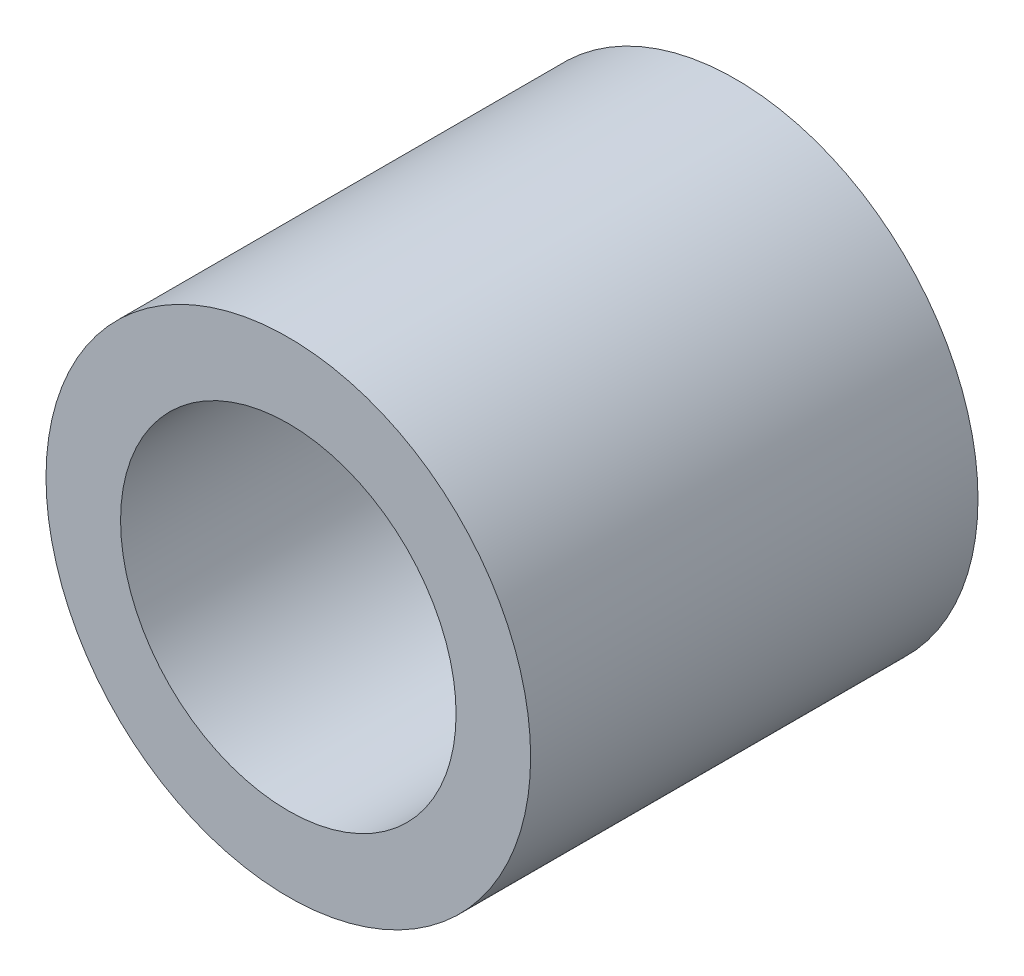
ISO-10303-21;
HEADER;
FILE_DESCRIPTION(('STEP AP214'),'2;1');
FILE_NAME('part.step','',(''),(''),'','','');
FILE_SCHEMA(('AUTOMOTIVE_DESIGN { 1 0 10303 214 1 1 1 1 }'));
ENDSEC;
DATA;
#1=APPLICATION_CONTEXT('core data for automotive mechanical design processes');
#2=APPLICATION_PROTOCOL_DEFINITION('international standard','automotive_design',2000,#1);
#3=PRODUCT_CONTEXT('',#1,'mechanical');
#4=PRODUCT('Part','Part','',(#3));
#5=PRODUCT_RELATED_PRODUCT_CATEGORY('part','',(#4));
#6=PRODUCT_DEFINITION_FORMATION('','',#4);
#7=PRODUCT_DEFINITION_CONTEXT('part definition',#1,'design');
#8=PRODUCT_DEFINITION('design','',#6,#7);
#9=PRODUCT_DEFINITION_SHAPE('','',#8);
#10=(LENGTH_UNIT() NAMED_UNIT(*) SI_UNIT(.MILLI.,.METRE.));
#11=(NAMED_UNIT(*) PLANE_ANGLE_UNIT() SI_UNIT($,.RADIAN.));
#12=(NAMED_UNIT(*) SI_UNIT($,.STERADIAN.) SOLID_ANGLE_UNIT());
#13=UNCERTAINTY_MEASURE_WITH_UNIT(LENGTH_MEASURE(1.E-05),#10,'distance_accuracy_value','');
#14=(GEOMETRIC_REPRESENTATION_CONTEXT(3) GLOBAL_UNCERTAINTY_ASSIGNED_CONTEXT((#13)) GLOBAL_UNIT_ASSIGNED_CONTEXT((#10,
#11,#12)) REPRESENTATION_CONTEXT('',''));
#15=CARTESIAN_POINT('',(0.,0.,0.));
#16=DIRECTION('',(0.,0.,1.));
#17=DIRECTION('',(1.,0.,0.));
#18=AXIS2_PLACEMENT_3D('',#15,#16,#17);
#19=CARTESIAN_POINT('',(0.,0.,6.));
#20=DIRECTION('',(0.,0.,1.));
#21=DIRECTION('',(1.,0.,0.));
#22=AXIS2_PLACEMENT_3D('',#19,#20,#21);
#23=PLANE('',#22);
#24=CARTESIAN_POINT('',(0.,0.,6.));
#25=DIRECTION('',(0.,0.,1.));
#26=DIRECTION('',(1.,0.,0.));
#27=AXIS2_PLACEMENT_3D('',#24,#25,#26);
#28=CIRCLE('',#27,3.25);
#29=CARTESIAN_POINT('',(3.25,0.,6.));
#30=VERTEX_POINT('',#29);
#31=EDGE_CURVE('E10',#30,#30,#28,.T.);
#32=ORIENTED_EDGE('',*,*,#31,.T.);
#33=EDGE_LOOP('',(#32));
#34=FACE_BOUND('',#33,.T.);
#35=CARTESIAN_POINT('',(0.,0.,6.));
#36=DIRECTION('',(0.,0.,1.));
#37=DIRECTION('',(1.,0.,0.));
#38=AXIS2_PLACEMENT_3D('',#35,#36,#37);
#39=CIRCLE('',#38,2.25);
#40=CARTESIAN_POINT('',(2.25,0.,6.));
#41=VERTEX_POINT('',#40);
#42=EDGE_CURVE('E41',#41,#41,#39,.T.);
#43=ORIENTED_EDGE('',*,*,#42,.F.);
#44=EDGE_LOOP('',(#43));
#45=FACE_BOUND('',#44,.T.);
#46=ADVANCED_FACE('F30',(#34,#45),#23,.T.);
#47=CARTESIAN_POINT('',(0.,0.,0.));
#48=DIRECTION('',(0.,0.,1.));
#49=DIRECTION('',(1.,0.,0.));
#50=AXIS2_PLACEMENT_3D('',#47,#48,#49);
#51=PLANE('',#50);
#52=CARTESIAN_POINT('',(0.,0.,0.));
#53=DIRECTION('',(0.,0.,1.));
#54=DIRECTION('',(1.,0.,0.));
#55=AXIS2_PLACEMENT_3D('',#52,#53,#54);
#56=CIRCLE('',#55,3.25);
#57=CARTESIAN_POINT('',(3.25,0.,0.));
#58=VERTEX_POINT('',#57);
#59=EDGE_CURVE('E34',#58,#58,#56,.T.);
#60=ORIENTED_EDGE('',*,*,#59,.F.);
#61=EDGE_LOOP('',(#60));
#62=FACE_BOUND('',#61,.T.);
#63=CARTESIAN_POINT('',(0.,0.,0.));
#64=DIRECTION('',(0.,0.,1.));
#65=DIRECTION('',(1.,0.,0.));
#66=AXIS2_PLACEMENT_3D('',#63,#64,#65);
#67=CIRCLE('',#66,2.25);
#68=CARTESIAN_POINT('',(2.25,0.,0.));
#69=VERTEX_POINT('',#68);
#70=EDGE_CURVE('E43',#69,#69,#67,.T.);
#71=ORIENTED_EDGE('',*,*,#70,.T.);
#72=EDGE_LOOP('',(#71));
#73=FACE_BOUND('',#72,.T.);
#74=ADVANCED_FACE('F53',(#62,#73),#51,.F.);
#75=CARTESIAN_POINT('',(0.,0.,6.));
#76=DIRECTION('',(0.,0.,-1.));
#77=DIRECTION('',(-1.,0.,0.));
#78=AXIS2_PLACEMENT_3D('',#75,#76,#77);
#79=CYLINDRICAL_SURFACE('',#78,3.25);
#80=ORIENTED_EDGE('',*,*,#31,.F.);
#81=EDGE_LOOP('',(#80));
#82=FACE_BOUND('',#81,.T.);
#83=ORIENTED_EDGE('',*,*,#59,.T.);
#84=EDGE_LOOP('',(#83));
#85=FACE_BOUND('',#84,.T.);
#86=ADVANCED_FACE('F32',(#82,#85),#79,.T.);
#87=CARTESIAN_POINT('',(0.,0.,6.));
#88=DIRECTION('',(0.,0.,-1.));
#89=DIRECTION('',(-1.,0.,0.));
#90=AXIS2_PLACEMENT_3D('',#87,#88,#89);
#91=CYLINDRICAL_SURFACE('',#90,2.25);
#92=ORIENTED_EDGE('',*,*,#42,.T.);
#93=EDGE_LOOP('',(#92));
#94=FACE_BOUND('',#93,.T.);
#95=ORIENTED_EDGE('',*,*,#70,.F.);
#96=EDGE_LOOP('',(#95));
#97=FACE_BOUND('',#96,.T.);
#98=ADVANCED_FACE('F49',(#94,#97),#91,.F.);
#99=CLOSED_SHELL('',(#46,#74,#86,#98));
#100=MANIFOLD_SOLID_BREP('B2',#99);
#101=ADVANCED_BREP_SHAPE_REPRESENTATION('',(#18,#100),#14);
#102=SHAPE_DEFINITION_REPRESENTATION(#9,#101);
ENDSEC;
END-ISO-10303-21;
